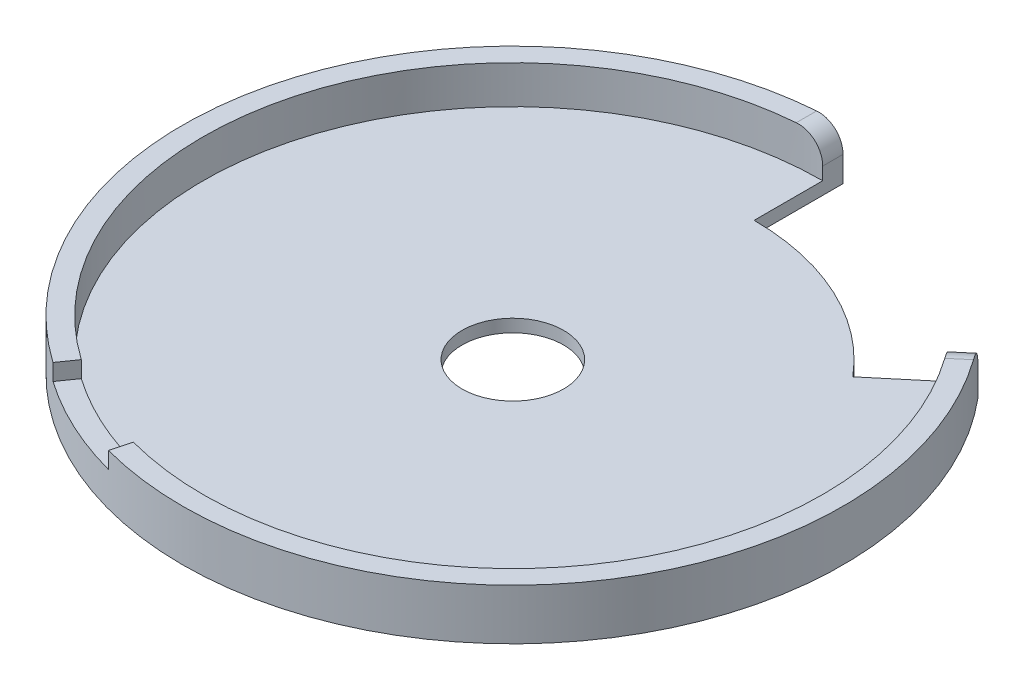
ISO-10303-21;
HEADER;
FILE_DESCRIPTION(('STEP AP214'),'2;1');
FILE_NAME('part.step','',(''),(''),'','','');
FILE_SCHEMA(('AUTOMOTIVE_DESIGN { 1 0 10303 214 1 1 1 1 }'));
ENDSEC;
DATA;
#1=APPLICATION_CONTEXT('core data for automotive mechanical design processes');
#2=APPLICATION_PROTOCOL_DEFINITION('international standard','automotive_design',2000,#1);
#3=PRODUCT_CONTEXT('',#1,'mechanical');
#4=PRODUCT('Part','Part','',(#3));
#5=PRODUCT_RELATED_PRODUCT_CATEGORY('part','',(#4));
#6=PRODUCT_DEFINITION_FORMATION('','',#4);
#7=PRODUCT_DEFINITION_CONTEXT('part definition',#1,'design');
#8=PRODUCT_DEFINITION('design','',#6,#7);
#9=PRODUCT_DEFINITION_SHAPE('','',#8);
#10=(LENGTH_UNIT() NAMED_UNIT(*) SI_UNIT(.MILLI.,.METRE.));
#11=(NAMED_UNIT(*) PLANE_ANGLE_UNIT() SI_UNIT($,.RADIAN.));
#12=(NAMED_UNIT(*) SI_UNIT($,.STERADIAN.) SOLID_ANGLE_UNIT());
#13=UNCERTAINTY_MEASURE_WITH_UNIT(LENGTH_MEASURE(1.E-05),#10,'distance_accuracy_value','');
#14=(GEOMETRIC_REPRESENTATION_CONTEXT(3) GLOBAL_UNCERTAINTY_ASSIGNED_CONTEXT((#13)) GLOBAL_UNIT_ASSIGNED_CONTEXT((#10,
#11,#12)) REPRESENTATION_CONTEXT('',''));
#15=CARTESIAN_POINT('',(0.,0.,0.));
#16=DIRECTION('',(0.,0.,1.));
#17=DIRECTION('',(1.,0.,0.));
#18=AXIS2_PLACEMENT_3D('',#15,#16,#17);
#19=CARTESIAN_POINT('',(0.,40.,0.));
#20=DIRECTION('',(0.,1.,0.));
#21=DIRECTION('',(0.,0.,1.));
#22=AXIS2_PLACEMENT_3D('',#19,#20,#21);
#23=PLANE('',#22);
#24=DIRECTION('',(-0.573576436351047,0.,0.819152044288991));
#25=VECTOR('',#24,1.);
#26=CARTESIAN_POINT('',(-139.952650469655,40.,199.873098806514));
#27=LINE('',#26,#25);
#28=CARTESIAN_POINT('',(-139.952650469655,40.,199.873098806514));
#29=VERTEX_POINT('',#28);
#30=CARTESIAN_POINT('',(-149.129873451272,40.,212.979531515138));
#31=VERTEX_POINT('',#30);
#32=EDGE_CURVE('E146',#29,#31,#27,.T.);
#33=ORIENTED_EDGE('',*,*,#32,.F.);
#34=CARTESIAN_POINT('',(0.,40.,0.));
#35=DIRECTION('',(0.,1.,0.));
#36=DIRECTION('',(0.,0.,1.));
#37=AXIS2_PLACEMENT_3D('',#34,#35,#36);
#38=CIRCLE('',#37,244.);
#39=CARTESIAN_POINT('',(-20.,40.,-243.178946457131));
#40=VERTEX_POINT('',#39);
#41=EDGE_CURVE('E187',#40,#29,#38,.T.);
#42=ORIENTED_EDGE('',*,*,#41,.F.);
#43=DIRECTION('',(0.,0.,-1.));
#44=VECTOR('',#43,1.);
#45=CARTESIAN_POINT('',(-20.,40.,0.));
#46=LINE('',#45,#44);
#47=CARTESIAN_POINT('',(-20.,40.,-259.229627936314));
#48=VERTEX_POINT('',#47);
#49=EDGE_CURVE('E213',#40,#48,#46,.T.);
#50=ORIENTED_EDGE('',*,*,#49,.T.);
#51=CARTESIAN_POINT('',(0.,40.,0.));
#52=DIRECTION('',(0.,1.,0.));
#53=DIRECTION('',(0.,0.,1.));
#54=AXIS2_PLACEMENT_3D('',#51,#52,#53);
#55=CIRCLE('',#54,260.);
#56=EDGE_CURVE('E190',#48,#31,#55,.T.);
#57=ORIENTED_EDGE('',*,*,#56,.T.);
#58=EDGE_LOOP('',(#33,#42,#50,#57));
#59=FACE_BOUND('',#58,.T.);
#60=ADVANCED_FACE('F40',(#59),#23,.T.);
#61=CARTESIAN_POINT('',(0.,10.,0.));
#62=DIRECTION('',(0.,1.,0.));
#63=DIRECTION('',(0.,0.,1.));
#64=AXIS2_PLACEMENT_3D('',#61,#62,#63);
#65=PLANE('',#64);
#66=CARTESIAN_POINT('',(0.,10.,0.));
#67=DIRECTION('',(0.,1.,0.));
#68=DIRECTION('',(0.,0.,1.));
#69=AXIS2_PLACEMENT_3D('',#66,#67,#68);
#70=CIRCLE('',#69,40.);
#71=CARTESIAN_POINT('',(0.,10.,40.));
#72=VERTEX_POINT('',#71);
#73=EDGE_CURVE('E194',#72,#72,#70,.T.);
#74=ORIENTED_EDGE('',*,*,#73,.F.);
#75=EDGE_LOOP('',(#74));
#76=FACE_BOUND('',#75,.T.);
#77=CARTESIAN_POINT('',(0.,10.,0.));
#78=DIRECTION('',(0.,1.,0.));
#79=DIRECTION('',(0.,0.,1.));
#80=AXIS2_PLACEMENT_3D('',#77,#78,#79);
#81=CIRCLE('',#80,190.);
#82=CARTESIAN_POINT('',(145.548444192606,10.,-122.129645840442));
#83=VERTEX_POINT('',#82);
#84=CARTESIAN_POINT('',(0.,10.,-190.));
#85=VERTEX_POINT('',#84);
#86=EDGE_CURVE('E183',#83,#85,#81,.T.);
#87=ORIENTED_EDGE('',*,*,#86,.T.);
#88=DIRECTION('',(0.,0.,-1.));
#89=VECTOR('',#88,1.);
#90=CARTESIAN_POINT('',(0.,10.,0.));
#91=LINE('',#90,#89);
#92=CARTESIAN_POINT('',(0.,10.,-244.));
#93=VERTEX_POINT('',#92);
#94=EDGE_CURVE('E180',#85,#93,#91,.T.);
#95=ORIENTED_EDGE('',*,*,#94,.T.);
#96=CARTESIAN_POINT('',(0.,10.,0.));
#97=DIRECTION('',(0.,1.,0.));
#98=DIRECTION('',(0.,0.,1.));
#99=AXIS2_PLACEMENT_3D('',#96,#97,#98);
#100=CIRCLE('',#99,244.);
#101=CARTESIAN_POINT('',(186.914844121031,10.,-156.840176763515));
#102=VERTEX_POINT('',#101);
#103=EDGE_CURVE('E202',#102,#93,#100,.F.);
#104=ORIENTED_EDGE('',*,*,#103,.F.);
#105=DIRECTION('',(0.766044443118979,0.,-0.642787609686538));
#106=VECTOR('',#105,1.);
#107=CARTESIAN_POINT('',(0.,10.,0.));
#108=LINE('',#107,#106);
#109=EDGE_CURVE('E170',#83,#102,#108,.T.);
#110=ORIENTED_EDGE('',*,*,#109,.F.);
#111=EDGE_LOOP('',(#87,#95,#104,#110));
#112=FACE_BOUND('',#111,.T.);
#113=ADVANCED_FACE('F266',(#76,#112),#65,.T.);
#114=CARTESIAN_POINT('',(0.,0.,0.));
#115=DIRECTION('',(0.,1.,0.));
#116=DIRECTION('',(0.,0.,1.));
#117=AXIS2_PLACEMENT_3D('',#114,#115,#116);
#118=PLANE('',#117);
#119=CARTESIAN_POINT('',(0.,0.,0.));
#120=DIRECTION('',(0.,1.,0.));
#121=DIRECTION('',(0.,0.,1.));
#122=AXIS2_PLACEMENT_3D('',#119,#120,#121);
#123=CIRCLE('',#122,40.);
#124=CARTESIAN_POINT('',(0.,0.,40.));
#125=VERTEX_POINT('',#124);
#126=EDGE_CURVE('E193',#125,#125,#123,.T.);
#127=ORIENTED_EDGE('',*,*,#126,.T.);
#128=EDGE_LOOP('',(#127));
#129=FACE_BOUND('',#128,.T.);
#130=DIRECTION('',(0.,0.,-1.));
#131=VECTOR('',#130,1.);
#132=CARTESIAN_POINT('',(0.,0.,0.));
#133=LINE('',#132,#131);
#134=CARTESIAN_POINT('',(0.,0.,-190.));
#135=VERTEX_POINT('',#134);
#136=CARTESIAN_POINT('',(0.,0.,-260.));
#137=VERTEX_POINT('',#136);
#138=EDGE_CURVE('E164',#135,#137,#133,.T.);
#139=ORIENTED_EDGE('',*,*,#138,.F.);
#140=CARTESIAN_POINT('',(0.,0.,0.));
#141=DIRECTION('',(0.,1.,0.));
#142=DIRECTION('',(0.,0.,1.));
#143=AXIS2_PLACEMENT_3D('',#140,#141,#142);
#144=CIRCLE('',#143,190.);
#145=CARTESIAN_POINT('',(145.548444192606,0.,-122.129645840442));
#146=VERTEX_POINT('',#145);
#147=EDGE_CURVE('E158',#146,#135,#144,.T.);
#148=ORIENTED_EDGE('',*,*,#147,.F.);
#149=DIRECTION('',(0.766044443118979,0.,-0.642787609686538));
#150=VECTOR('',#149,1.);
#151=CARTESIAN_POINT('',(0.,0.,0.));
#152=LINE('',#151,#150);
#153=CARTESIAN_POINT('',(199.171555210935,0.,-167.1247785185));
#154=VERTEX_POINT('',#153);
#155=EDGE_CURVE('E160',#146,#154,#152,.T.);
#156=ORIENTED_EDGE('',*,*,#155,.T.);
#157=CARTESIAN_POINT('',(0.,0.,0.));
#158=DIRECTION('',(0.,1.,0.));
#159=DIRECTION('',(0.,0.,1.));
#160=AXIS2_PLACEMENT_3D('',#157,#158,#159);
#161=CIRCLE('',#160,260.);
#162=EDGE_CURVE('E197',#137,#154,#161,.T.);
#163=ORIENTED_EDGE('',*,*,#162,.F.);
#164=EDGE_LOOP('',(#139,#148,#156,#163));
#165=FACE_BOUND('',#164,.T.);
#166=ADVANCED_FACE('F233',(#129,#165),#118,.F.);
#167=CARTESIAN_POINT('',(0.,10.,0.));
#168=DIRECTION('',(0.,-1.,0.));
#169=DIRECTION('',(0.,0.,-1.));
#170=AXIS2_PLACEMENT_3D('',#167,#168,#169);
#171=CYLINDRICAL_SURFACE('',#170,260.);
#172=CARTESIAN_POINT('',(0.,27.,0.));
#173=DIRECTION('',(0.,1.,0.));
#174=DIRECTION('',(0.,0.,1.));
#175=AXIS2_PLACEMENT_3D('',#172,#173,#174);
#176=CIRCLE('',#175,260.);
#177=CARTESIAN_POINT('',(-149.129873451272,27.,212.979531515138));
#178=VERTEX_POINT('',#177);
#179=CARTESIAN_POINT('',(-67.2929517266545,27.,251.140714835158));
#180=VERTEX_POINT('',#179);
#181=EDGE_CURVE('E137',#178,#180,#176,.T.);
#182=ORIENTED_EDGE('',*,*,#181,.F.);
#183=DIRECTION('',(0.,1.,0.));
#184=VECTOR('',#183,1.);
#185=CARTESIAN_POINT('',(-149.129873451272,27.,212.979531515138));
#186=LINE('',#185,#184);
#187=EDGE_CURVE('E161',#178,#31,#186,.T.);
#188=ORIENTED_EDGE('',*,*,#187,.T.);
#189=ORIENTED_EDGE('',*,*,#56,.F.);
#190=CARTESIAN_POINT('',(-20.,40.,-259.229627936314));
#191=CARTESIAN_POINT('',(-19.71963023319,40.0000003433928,-259.251259605967));
#192=CARTESIAN_POINT('',(-19.4392560306595,39.9941037453855,-259.272432580726));
#193=CARTESIAN_POINT('',(-18.8789397233273,39.9705247963347,-259.313833988454));
#194=CARTESIAN_POINT('',(-18.5989976096783,39.9528426899021,-259.334062441017));
#195=CARTESIAN_POINT('',(-17.7605973196725,39.8821412315805,-259.393282145943));
#196=CARTESIAN_POINT('',(-17.2034304070211,39.8114667318043,-259.430818138245));
#197=CARTESIAN_POINT('',(-16.097158092556,39.6235162871878,-259.501808322751));
#198=CARTESIAN_POINT('',(-15.5480472262984,39.5062736040331,-259.535265406103));
#199=CARTESIAN_POINT('',(-14.7332216756831,39.2961080564091,-259.582369107054));
#200=CARTESIAN_POINT('',(-14.4630765765975,39.2203324420792,-259.597557202338));
#201=CARTESIAN_POINT('',(-13.9260924750764,39.0574496866536,-259.626917452466));
#202=CARTESIAN_POINT('',(-13.6592543404177,38.9703396374848,-259.641089345131));
#203=CARTESIAN_POINT('',(-12.8643143891813,38.6921689534802,-259.682095670225));
#204=CARTESIAN_POINT('',(-12.3419154667438,38.4843009179883,-259.707413356375));
#205=CARTESIAN_POINT('',(-11.3163286813734,38.0252459934356,-259.754122740228));
#206=CARTESIAN_POINT('',(-10.8131408062476,37.7740591318687,-259.775514440423));
#207=CARTESIAN_POINT('',(-10.0755964519667,37.366208725558,-259.804817137442));
#208=CARTESIAN_POINT('',(-9.83260383115022,37.2250685973756,-259.814121148658));
#209=CARTESIAN_POINT('',(-9.3528179398351,36.9327025996843,-259.831834855501));
#210=CARTESIAN_POINT('',(-9.11602309501908,36.7814793267401,-259.840244779934));
#211=CARTESIAN_POINT('',(-8.41544794325434,36.3129909861737,-259.864192325958));
#212=CARTESIAN_POINT('',(-7.96142692776552,35.9808796905821,-259.87844968902));
#213=CARTESIAN_POINT('',(-7.0836557052645,35.2801519563588,-259.903856174274));
#214=CARTESIAN_POINT('',(-6.6598593764486,34.9115932795034,-259.915010111077));
#215=CARTESIAN_POINT('',(-5.84470458589178,34.1401019739333,-259.934618031634));
#216=CARTESIAN_POINT('',(-5.4533462650866,33.7371691958865,-259.943072003659));
#217=CARTESIAN_POINT('',(-4.70580258407628,32.8997150553843,-259.957679770067));
#218=CARTESIAN_POINT('',(-4.34962467887993,32.4651870313709,-259.963833077688));
#219=CARTESIAN_POINT('',(-3.67507101337062,31.5677053128119,-259.974244253692));
#220=CARTESIAN_POINT('',(-3.35669471514251,31.1047520228988,-259.97850214905));
#221=CARTESIAN_POINT('',(-2.75975145428004,30.1533000996564,-259.985524574331));
#222=CARTESIAN_POINT('',(-2.48121830608255,29.6647802428531,-259.988287841246));
#223=CARTESIAN_POINT('',(-1.96624521688504,28.6659903369339,-259.992692645751));
#224=CARTESIAN_POINT('',(-1.72980782558633,28.1557189726677,-259.994334115412));
#225=CARTESIAN_POINT('',(-1.30083440030042,27.1173483619554,-259.996834278522));
#226=CARTESIAN_POINT('',(-1.10827708703372,26.5892578999918,-259.997693351996));
#227=CARTESIAN_POINT('',(-0.768312740479441,25.5188219180142,-259.998920493332));
#228=CARTESIAN_POINT('',(-0.620895074602859,24.9764797876945,-259.999288676892));
#229=CARTESIAN_POINT('',(-0.414079154070954,24.0657753404818,-259.999683139849));
#230=CARTESIAN_POINT('',(-0.341755582074536,23.7002927472899,-259.999782786299));
#231=CARTESIAN_POINT('',(-0.217626554493528,22.9658652583614,-259.999916340178));
#232=CARTESIAN_POINT('',(-0.165819546275666,22.5969206267858,-259.999950252581));
#233=CARTESIAN_POINT('',(-0.082950832928738,21.8572621246842,-259.999990240716));
#234=CARTESIAN_POINT('',(-0.0518588466107511,21.486551638002,-259.999996357156));
#235=CARTESIAN_POINT('',(-0.0103757520134408,20.7438955815616,-259.999999918523));
#236=CARTESIAN_POINT('',(1.09685559338387E-05,20.3719497667453,-259.999997361612));
#237=CARTESIAN_POINT('',(0.,20.,-260.));
#238=B_SPLINE_CURVE_WITH_KNOTS('',3,(#190,#191,#192,#193,#194,#195,#196,#197,#198,#199,#200,
#201,#202,#203,#204,#205,#206,#207,#208,#209,#210,#211,#212,#213,#214,#215,#216,#217,#218,#219,
#220,#221,#222,#223,#224,#225,#226,#227,#228,#229,#230,#231,#232,#233,#234,#235,#236,#237),
.UNSPECIFIED.,.F.,.F.,(4,2,2,2,2,2,2,2,2,2,2,2,2,2,2,2,2,2,2,2,2,2,2,4),(0.,0.843485041896762,
1.68695257761325,3.37348339970604,5.05881176408558,5.9015396333662,6.74448414906235,
8.43077044189332,10.1170556644621,10.9603235850852,11.8033751837356,13.4893071036572,
15.172608721575,16.855917652671,18.5395825284052,20.2232234427925,21.9082848730087,
23.5934483311515,25.277792835917,26.9617402896422,28.0789221002924,29.1960193497417,
30.3114800240884,31.4271770536641),.UNSPECIFIED.);
#239=CARTESIAN_POINT('',(0.,20.,-260.));
#240=VERTEX_POINT('',#239);
#241=EDGE_CURVE('E223',#48,#240,#238,.T.);
#242=ORIENTED_EDGE('',*,*,#241,.T.);
#243=DIRECTION('',(0.,1.,0.));
#244=VECTOR('',#243,1.);
#245=CARTESIAN_POINT('',(0.,0.,-260.));
#246=LINE('',#245,#244);
#247=EDGE_CURVE('E171',#137,#240,#246,.T.);
#248=ORIENTED_EDGE('',*,*,#247,.F.);
#249=ORIENTED_EDGE('',*,*,#162,.T.);
#250=DIRECTION('',(0.,1.,0.));
#251=VECTOR('',#250,1.);
#252=CARTESIAN_POINT('',(199.171555210935,0.,-167.1247785185));
#253=LINE('',#252,#251);
#254=CARTESIAN_POINT('',(199.171555210935,20.,-167.1247785185));
#255=VERTEX_POINT('',#254);
#256=EDGE_CURVE('E174',#154,#255,#253,.T.);
#257=ORIENTED_EDGE('',*,*,#256,.T.);
#258=CARTESIAN_POINT('',(199.171555210935,20.,-167.1247785185));
#259=CARTESIAN_POINT('',(199.171554491482,20.2812658629448,-167.124778361103));
#260=CARTESIAN_POINT('',(199.175369570374,20.5625004366831,-167.120232864921));
#261=CARTESIAN_POINT('',(199.190616012421,21.1244625662427,-167.102060722216));
#262=CARTESIAN_POINT('',(199.202047193909,21.4051901339972,-167.088434292298));
#263=CARTESIAN_POINT('',(199.247734331528,22.245821094565,-167.033956946783));
#264=CARTESIAN_POINT('',(199.293383897176,22.8043184588376,-166.979507964408));
#265=CARTESIAN_POINT('',(199.41462434993,23.9129220375701,-166.8346980839));
#266=CARTESIAN_POINT('',(199.490192899766,24.4630341948798,-166.744363977141));
#267=CARTESIAN_POINT('',(199.625446202517,25.2791442412815,-166.582370264541));
#268=CARTESIAN_POINT('',(199.674183154871,25.5496820922155,-166.523954007258));
#269=CARTESIAN_POINT('',(199.778863788576,26.0873821323232,-166.398354178304));
#270=CARTESIAN_POINT('',(199.834809314876,26.3545434380216,-166.331168362111));
#271=CARTESIAN_POINT('',(200.013300323453,27.150303810022,-166.116568920179));
#272=CARTESIAN_POINT('',(200.14648749881,27.6731025970718,-165.956128527241));
#273=CARTESIAN_POINT('',(200.440015664363,28.6992656058067,-165.601488612789));
#274=CARTESIAN_POINT('',(200.600356648084,29.2026298321261,-165.407289099325));
#275=CARTESIAN_POINT('',(200.860106998504,29.9403071287651,-165.091598633957));
#276=CARTESIAN_POINT('',(200.949905807449,30.1833256493386,-164.982292427539));
#277=CARTESIAN_POINT('',(201.135703495956,30.6631209148689,-164.755729024502));
#278=CARTESIAN_POINT('',(201.231700781722,30.8998992424723,-164.638473871389));
#279=CARTESIAN_POINT('',(201.528734488828,31.60036774549,-164.274974132748));
#280=CARTESIAN_POINT('',(201.738830151301,32.0542407721695,-164.016974163488));
#281=CARTESIAN_POINT('',(202.181173529846,32.9321638129348,-163.471392998235));
#282=CARTESIAN_POINT('',(202.413415551536,33.3562214448425,-163.183819404873));
#283=CARTESIAN_POINT('',(202.898120064262,34.1717056744997,-162.58075677978));
#284=CARTESIAN_POINT('',(203.150582658367,34.5631321058996,-162.265267605756));
#285=CARTESIAN_POINT('',(203.673605562925,35.3106111997474,-161.608287779983));
#286=CARTESIAN_POINT('',(203.944169076797,35.6666575729372,-161.26679252431));
#287=CARTESIAN_POINT('',(204.501064899827,36.340766453533,-160.560010029154));
#288=CARTESIAN_POINT('',(204.787396955929,36.6588295702414,-160.194723171467));
#289=CARTESIAN_POINT('',(205.373190009658,37.254460702878,-159.44302944903));
#290=CARTESIAN_POINT('',(205.672639325553,37.5320638343232,-159.056641303547));
#291=CARTESIAN_POINT('',(206.282468868056,38.045166096195,-158.264944525697));
#292=CARTESIAN_POINT('',(206.592849741915,38.2806627284821,-157.859634772527));
#293=CARTESIAN_POINT('',(207.221874239612,38.7077840727051,-157.033004417618));
#294=CARTESIAN_POINT('',(207.540514000695,38.8994288965491,-156.611691259374));
#295=CARTESIAN_POINT('',(208.183646821511,39.2376343435918,-155.755756002289));
#296=CARTESIAN_POINT('',(208.508138483382,39.3842055865171,-155.32113706498));
#297=CARTESIAN_POINT('',(209.05027016703,39.5895746634136,-154.590155635691));
#298=CARTESIAN_POINT('',(209.266987242077,39.6612982742836,-154.296670240893));
#299=CARTESIAN_POINT('',(209.701194379732,39.7843712705844,-153.706029079294));
#300=CARTESIAN_POINT('',(209.918684383133,39.8357221840246,-153.408873589484));
#301=CARTESIAN_POINT('',(210.353401366117,39.9178421120331,-152.812245768728));
#302=CARTESIAN_POINT('',(210.570628246069,39.9486421347024,-152.512777621077));
#303=CARTESIAN_POINT('',(211.004509636666,39.9897286368536,-151.91193083629));
#304=CARTESIAN_POINT('',(211.221164020249,40.0000108912046,-151.610551818472));
#305=CARTESIAN_POINT('',(211.437168166145,40.,-151.308704038735));
#306=B_SPLINE_CURVE_WITH_KNOTS('',3,(#258,#259,#260,#261,#262,#263,#264,#265,#266,#267,#268,
#269,#270,#271,#272,#273,#274,#275,#276,#277,#278,#279,#280,#281,#282,#283,#284,#285,#286,#287,
#288,#289,#290,#291,#292,#293,#294,#295,#296,#297,#298,#299,#300,#301,#302,#303,#304,#305),
.UNSPECIFIED.,.F.,.F.,(4,2,2,2,2,2,2,2,2,2,2,2,2,2,2,2,2,2,2,2,2,2,2,4),(0.,0.843672533362317,
1.68732494353202,3.37419404198823,5.0598061053433,5.90268100672644,6.74577206204334,
8.43219118136804,10.1186098985534,10.9619699169116,11.8051139415565,13.4912333224823,
15.176920323153,16.8626159167139,18.5486106301863,20.2345782943978,21.9190738682577,
23.6036693485363,25.2874906613572,26.9709149467822,28.0858273977114,29.2006562112743,
30.3137990944682,31.4271711784874),.UNSPECIFIED.);
#307=CARTESIAN_POINT('',(211.437168166145,40.,-151.308704038735));
#308=VERTEX_POINT('',#307);
#309=EDGE_CURVE('E216',#255,#308,#306,.T.);
#310=ORIENTED_EDGE('',*,*,#309,.T.);
#311=CARTESIAN_POINT('',(-67.2929517266545,40.,251.140714835158));
#312=VERTEX_POINT('',#311);
#313=EDGE_CURVE('E151',#312,#308,#55,.T.);
#314=ORIENTED_EDGE('',*,*,#313,.F.);
#315=DIRECTION('',(0.,1.,0.));
#316=VECTOR('',#315,1.);
#317=CARTESIAN_POINT('',(-67.2929517266545,27.,251.140714835158));
#318=LINE('',#317,#316);
#319=EDGE_CURVE('E131',#180,#312,#318,.T.);
#320=ORIENTED_EDGE('',*,*,#319,.F.);
#321=EDGE_LOOP('',(#182,#188,#189,#242,#248,#249,#257,#310,#314,#320));
#322=FACE_BOUND('',#321,.T.);
#323=ADVANCED_FACE('F149',(#322),#171,.T.);
#324=DIRECTION('',(0.25881904510252,0.,-0.965925826289068));
#325=VECTOR('',#324,1.);
#326=CARTESIAN_POINT('',(-63.1518470050142,40.,235.685901614533));
#327=LINE('',#326,#325);
#328=CARTESIAN_POINT('',(-63.1518470050142,40.,235.685901614533));
#329=VERTEX_POINT('',#328);
#330=EDGE_CURVE('E302',#312,#329,#327,.T.);
#331=ORIENTED_EDGE('',*,*,#330,.F.);
#332=ORIENTED_EDGE('',*,*,#313,.T.);
#333=DIRECTION('',(0.766044443118979,0.,-0.642787609686538));
#334=VECTOR('',#333,1.);
#335=CARTESIAN_POINT('',(199.770596314762,40.,-141.519287901136));
#336=LINE('',#335,#334);
#337=CARTESIAN_POINT('',(199.141632810743,40.,-140.99152485689));
#338=VERTEX_POINT('',#337);
#339=EDGE_CURVE('E210',#308,#338,#336,.F.);
#340=ORIENTED_EDGE('',*,*,#339,.T.);
#341=EDGE_CURVE('E186',#329,#338,#38,.T.);
#342=ORIENTED_EDGE('',*,*,#341,.F.);
#343=EDGE_LOOP('',(#331,#332,#340,#342));
#344=FACE_BOUND('',#343,.T.);
#345=ADVANCED_FACE('F232',(#344),#23,.T.);
#346=CARTESIAN_POINT('',(0.,40.,0.));
#347=DIRECTION('',(0.,-1.,0.));
#348=DIRECTION('',(0.,0.,-1.));
#349=AXIS2_PLACEMENT_3D('',#346,#347,#348);
#350=CYLINDRICAL_SURFACE('',#349,244.);
#351=DIRECTION('',(0.,1.,0.));
#352=VECTOR('',#351,1.);
#353=CARTESIAN_POINT('',(-139.952650469655,27.,199.873098806514));
#354=LINE('',#353,#352);
#355=CARTESIAN_POINT('',(-139.952650469655,27.,199.873098806514));
#356=VERTEX_POINT('',#355);
#357=EDGE_CURVE('E153',#356,#29,#354,.T.);
#358=ORIENTED_EDGE('',*,*,#357,.F.);
#359=CARTESIAN_POINT('',(0.,27.,0.));
#360=DIRECTION('',(0.,-1.,0.));
#361=DIRECTION('',(0.,0.,1.));
#362=AXIS2_PLACEMENT_3D('',#359,#360,#361);
#363=CIRCLE('',#362,244.);
#364=CARTESIAN_POINT('',(-63.1518470050142,27.,235.685901614533));
#365=VERTEX_POINT('',#364);
#366=EDGE_CURVE('E136',#365,#356,#363,.T.);
#367=ORIENTED_EDGE('',*,*,#366,.F.);
#368=DIRECTION('',(0.,1.,0.));
#369=VECTOR('',#368,1.);
#370=CARTESIAN_POINT('',(-63.1518470050142,27.,235.685901614533));
#371=LINE('',#370,#369);
#372=EDGE_CURVE('E134',#365,#329,#371,.T.);
#373=ORIENTED_EDGE('',*,*,#372,.T.);
#374=ORIENTED_EDGE('',*,*,#341,.T.);
#375=CARTESIAN_POINT('',(199.141632810743,40.,-140.99152485689));
#376=CARTESIAN_POINT('',(198.979150891471,40.0000003435848,-141.221021550371));
#377=CARTESIAN_POINT('',(198.816288774564,39.9941089473776,-141.450211323156));
#378=CARTESIAN_POINT('',(198.490065137133,39.970549589358,-141.907621004442));
#379=CARTESIAN_POINT('',(198.326703626833,39.9528818670852,-142.135840932575));
#380=CARTESIAN_POINT('',(197.836329052453,39.8822353901431,-142.818418028193));
#381=CARTESIAN_POINT('',(197.508948656605,39.8116133177467,-143.270801660178));
#382=CARTESIAN_POINT('',(196.856010044505,39.6237893071046,-144.166633878056));
#383=CARTESIAN_POINT('',(196.53045070333,39.5066203458351,-144.610088556629));
#384=CARTESIAN_POINT('',(196.045260419152,39.2965753797259,-145.266410571274));
#385=CARTESIAN_POINT('',(195.884049147463,39.2208416664113,-145.483715863106));
#386=CARTESIAN_POINT('',(195.56291654748,39.0580451759169,-145.915105425218));
#387=CARTESIAN_POINT('',(195.402995561603,38.9709794900829,-146.129188852726));
#388=CARTESIAN_POINT('',(194.925571106126,38.6929418915559,-146.766151231387));
#389=CARTESIAN_POINT('',(194.610486973554,38.485164427219,-147.183632992192));
#390=CARTESIAN_POINT('',(193.989443343774,38.0262908113285,-148.001214446463));
#391=CARTESIAN_POINT('',(193.683483839815,37.7751946918295,-148.401314152791));
#392=CARTESIAN_POINT('',(193.233339897799,37.3674785025833,-148.986365190748));
#393=CARTESIAN_POINT('',(193.084747363356,37.2263830976027,-149.178879174187));
#394=CARTESIAN_POINT('',(192.790813480894,36.9341055385016,-149.55854992224));
#395=CARTESIAN_POINT('',(192.64547130847,36.7829259817204,-149.745708048732));
#396=CARTESIAN_POINT('',(192.214698580869,36.3145669770376,-150.298795428718));
#397=CARTESIAN_POINT('',(191.934491143502,35.9825394233427,-150.656377509441));
#398=CARTESIAN_POINT('',(191.391043306099,35.2820465985939,-151.34616327291));
#399=CARTESIAN_POINT('',(191.12777375848,34.9136468478834,-151.678410745776));
#400=CARTESIAN_POINT('',(190.619864802884,34.1424810571771,-152.316228109624));
#401=CARTESIAN_POINT('',(190.37522547334,33.7397148725125,-152.621797888294));
#402=CARTESIAN_POINT('',(189.906661395573,32.9025991847397,-153.204437937943));
#403=CARTESIAN_POINT('',(189.682741067923,32.4682429767791,-153.481502128421));
#404=CARTESIAN_POINT('',(189.257635797897,31.5711086792008,-154.005393170866));
#405=CARTESIAN_POINT('',(189.056450535548,31.1083309897278,-154.252220448391));
#406=CARTESIAN_POINT('',(188.67841670948,30.1571893813543,-154.714395980536));
#407=CARTESIAN_POINT('',(188.501591041293,29.668801979076,-154.929714631933));
#408=CARTESIAN_POINT('',(188.174069472779,28.6702728242146,-155.327351002831));
#409=CARTESIAN_POINT('',(188.02337515231,28.1601297586423,-155.509666727058));
#410=CARTESIAN_POINT('',(187.749555228314,27.1220088938409,-155.840144246305));
#411=CARTESIAN_POINT('',(187.626416307981,26.5940398520408,-155.988322540081));
#412=CARTESIAN_POINT('',(187.408748731423,25.5238387874213,-156.249767679315));
#413=CARTESIAN_POINT('',(187.314213356691,24.9816101465231,-156.363042723093));
#414=CARTESIAN_POINT('',(187.181387895757,24.0706000832526,-156.521994468679));
#415=CARTESIAN_POINT('',(187.13486975073,23.7046951454,-156.577598614235));
#416=CARTESIAN_POINT('',(187.054999596581,22.9694104668254,-156.673006617173));
#417=CARTESIAN_POINT('',(187.021646593189,22.6000309906689,-156.712811667751));
#418=CARTESIAN_POINT('',(186.968284353917,21.8594938034829,-156.776472917722));
#419=CARTESIAN_POINT('',(186.948255686368,21.4883394805466,-156.800352342528));
#420=CARTESIAN_POINT('',(186.921529533998,20.7447915880106,-156.832209262813));
#421=CARTESIAN_POINT('',(186.914834870768,20.3723977728197,-156.840183392596));
#422=CARTESIAN_POINT('',(186.914844121031,20.,-156.840176763515));
#423=B_SPLINE_CURVE_WITH_KNOTS('',3,(#375,#376,#377,#378,#379,#380,#381,#382,#383,#384,#385,
#386,#387,#388,#389,#390,#391,#392,#393,#394,#395,#396,#397,#398,#399,#400,#401,#402,#403,#404,
#405,#406,#407,#408,#409,#410,#411,#412,#413,#414,#415,#416,#417,#418,#419,#420,#421,#422),
.UNSPECIFIED.,.F.,.F.,(4,2,2,2,2,2,2,2,2,2,2,2,2,2,2,2,2,2,2,2,2,2,2,4),(0.,0.843453026715168,
1.68688889745822,3.37336069961697,5.05863981538737,5.90134235151505,6.74426161797573,
8.43051987273962,10.1167768797195,10.9600274925052,11.803061744672,13.4889585145586,
15.1718719026989,16.8547923755682,18.538071089693,20.2213261104474,21.9061525796278,
23.591080875083,25.2751931215968,26.9589094899189,28.0774328776099,29.1958717749448,
30.3126759897389,31.4297165047396),.UNSPECIFIED.);
#424=CARTESIAN_POINT('',(186.914844121031,20.,-156.840176763515));
#425=VERTEX_POINT('',#424);
#426=EDGE_CURVE('E64',#338,#425,#423,.T.);
#427=ORIENTED_EDGE('',*,*,#426,.T.);
#428=DIRECTION('',(0.,-1.,0.));
#429=VECTOR('',#428,1.);
#430=CARTESIAN_POINT('',(186.914844121031,40.,-156.840176763515));
#431=LINE('',#430,#429);
#432=EDGE_CURVE('E205',#102,#425,#431,.F.);
#433=ORIENTED_EDGE('',*,*,#432,.F.);
#434=ORIENTED_EDGE('',*,*,#103,.T.);
#435=DIRECTION('',(0.,-1.,0.));
#436=VECTOR('',#435,1.);
#437=CARTESIAN_POINT('',(0.,40.,-244.));
#438=LINE('',#437,#436);
#439=CARTESIAN_POINT('',(0.,20.,-244.));
#440=VERTEX_POINT('',#439);
#441=EDGE_CURVE('E207',#93,#440,#438,.F.);
#442=ORIENTED_EDGE('',*,*,#441,.T.);
#443=CARTESIAN_POINT('',(0.,20.,-244.));
#444=CARTESIAN_POINT('',(3.41888492976386E-07,20.2812636337542,-243.999999304942));
#445=CARTESIAN_POINT('',(-0.00593390157275631,20.562495979109,-244.000000084236));
#446=CARTESIAN_POINT('',(-0.0296544187452636,21.1244536634199,-243.99999861809));
#447=CARTESIAN_POINT('',(-0.0474404097418833,21.4051790143098,-243.999996372722));
#448=CARTESIAN_POINT('',(-0.118538479500461,22.2458033799975,-243.999976143645));
#449=CARTESIAN_POINT('',(-0.1895906739878,22.8042963993353,-243.999944672772));
#450=CARTESIAN_POINT('',(-0.378450499550004,23.9128922446937,-243.999724721852));
#451=CARTESIAN_POINT('',(-0.496223314200273,24.4630010024284,-243.999536358607));
#452=CARTESIAN_POINT('',(-0.70725392770195,25.2791061117338,-243.998984928744));
#453=CARTESIAN_POINT('',(-0.783329840320601,25.5496423424017,-243.998756289792));
#454=CARTESIAN_POINT('',(-0.946830069562885,26.0873392027493,-243.998176637753));
#455=CARTESIAN_POINT('',(-1.03425729171085,26.3544989488924,-243.997825593295));
#456=CARTESIAN_POINT('',(-1.31337811009866,27.1502549832603,-243.996536477918));
#457=CARTESIAN_POINT('',(-1.5218909384803,27.6730510660757,-243.995362457482));
#458=CARTESIAN_POINT('',(-1.98223109042041,28.6992087388085,-243.992056569771));
#459=CARTESIAN_POINT('',(-2.23405840146062,29.2025703343425,-243.989924702773));
#460=CARTESIAN_POINT('',(-2.64284997186715,29.9402436031987,-243.985724719112));
#461=CARTESIAN_POINT('',(-2.78430297217117,30.1832608004965,-243.984157508997));
#462=CARTESIAN_POINT('',(-3.07728482317012,30.6630533136881,-243.980638135643));
#463=CARTESIAN_POINT('',(-3.22881108410252,30.8998302122249,-243.978686071095));
#464=CARTESIAN_POINT('',(-3.69819027104727,31.6002941631524,-243.972173288045));
#465=CARTESIAN_POINT('',(-4.03087096381642,32.0541638325105,-243.966955720897));
#466=CARTESIAN_POINT('',(-4.73311762006789,32.9320641896601,-243.954341727919));
#467=CARTESIAN_POINT('',(-5.10267286510417,33.3561034875917,-243.946945934028));
#468=CARTESIAN_POINT('',(-5.87615867010683,34.1715513514579,-243.929539724099));
#469=CARTESIAN_POINT('',(-6.28008940417151,34.5629597521099,-243.919529294818));
#470=CARTESIAN_POINT('',(-7.11949180489079,35.3104016282664,-243.896472106869));
#471=CARTESIAN_POINT('',(-7.55496895570331,35.6664289273365,-243.883424819384));
#472=CARTESIAN_POINT('',(-8.45427249084762,36.3405000729669,-243.853906321376));
#473=CARTESIAN_POINT('',(-8.91809841772377,36.6585445322004,-243.837435166092));
#474=CARTESIAN_POINT('',(-9.87028434601261,37.2540975726711,-243.800746966349));
#475=CARTESIAN_POINT('',(-10.3586189788655,37.5316469523622,-243.780533739249));
#476=CARTESIAN_POINT('',(-11.3567815685904,38.044657280363,-243.736072520536));
#477=CARTESIAN_POINT('',(-11.8666107925756,38.2801157430998,-243.711824290809));
#478=CARTESIAN_POINT('',(-12.9038183614399,38.7071816963988,-243.659108202674));
#479=CARTESIAN_POINT('',(-13.4311886279817,38.8988090611914,-243.630642266378));
#480=CARTESIAN_POINT('',(-14.4998546364377,39.2370045970094,-243.569374997841));
#481=CARTESIAN_POINT('',(-15.0411470747672,39.3835833526254,-243.536574686595));
#482=CARTESIAN_POINT('',(-15.9495866503153,39.5890819912536,-243.478423276017));
#483=CARTESIAN_POINT('',(-16.3139507075139,39.6608963448436,-243.454286583758));
#484=CARTESIAN_POINT('',(-17.0459787013553,39.7841218773644,-243.404127238826));
#485=CARTESIAN_POINT('',(-17.4136423892257,39.8355345814595,-243.378104727303));
#486=CARTESIAN_POINT('',(-18.1505620032421,39.9177510400496,-243.324255413841));
#487=CARTESIAN_POINT('',(-18.5198146725844,39.9485859043278,-243.29643140561));
#488=CARTESIAN_POINT('',(-19.2594005936545,39.989717955733,-243.239005016103));
#489=CARTESIAN_POINT('',(-19.6297340511766,40.000010935921,-243.209402271824));
#490=CARTESIAN_POINT('',(-20.,40.,-243.178946457131));
#491=B_SPLINE_CURVE_WITH_KNOTS('',3,(#443,#444,#445,#446,#447,#448,#449,#450,#451,#452,#453,
#454,#455,#456,#457,#458,#459,#460,#461,#462,#463,#464,#465,#466,#467,#468,#469,#470,#471,#472,
#473,#474,#475,#476,#477,#478,#479,#480,#481,#482,#483,#484,#485,#486,#487,#488,#489,#490),
.UNSPECIFIED.,.F.,.F.,(4,2,2,2,2,2,2,2,2,2,2,2,2,2,2,2,2,2,2,2,2,2,2,4),(0.,0.843665848887379,
1.68731157347271,3.37416736841751,5.05976846482927,5.90263787247598,6.74572345107792,
8.43213244212661,10.1185409457895,10.961896094393,11.8050352547802,13.4911448027485,
15.176765663659,16.8623950620826,18.5483182037063,20.234214147276,21.9183996589591,
23.602684593137,25.2862043053523,26.9693281559791,28.0852745286624,29.2011374609245,
30.3153095756038,31.4297098472108),.UNSPECIFIED.);
#492=EDGE_CURVE('E49',#440,#40,#491,.T.);
#493=ORIENTED_EDGE('',*,*,#492,.T.);
#494=ORIENTED_EDGE('',*,*,#41,.T.);
#495=EDGE_LOOP('',(#358,#367,#373,#374,#427,#433,#434,#442,#493,#494));
#496=FACE_BOUND('',#495,.T.);
#497=ADVANCED_FACE('F252',(#496),#350,.F.);
#498=CARTESIAN_POINT('',(0.,10.,0.));
#499=DIRECTION('',(0.,-1.,0.));
#500=DIRECTION('',(0.,0.,-1.));
#501=AXIS2_PLACEMENT_3D('',#498,#499,#500);
#502=CYLINDRICAL_SURFACE('',#501,40.);
#503=ORIENTED_EDGE('',*,*,#73,.T.);
#504=EDGE_LOOP('',(#503));
#505=FACE_BOUND('',#504,.T.);
#506=ORIENTED_EDGE('',*,*,#126,.F.);
#507=EDGE_LOOP('',(#506));
#508=FACE_BOUND('',#507,.T.);
#509=ADVANCED_FACE('F257',(#505,#508),#502,.F.);
#510=CARTESIAN_POINT('',(0.,0.,0.));
#511=DIRECTION('',(0.,1.,0.));
#512=DIRECTION('',(0.,0.,1.));
#513=AXIS2_PLACEMENT_3D('',#510,#511,#512);
#514=CYLINDRICAL_SURFACE('',#513,190.);
#515=DIRECTION('',(0.,1.,0.));
#516=VECTOR('',#515,1.);
#517=CARTESIAN_POINT('',(145.548444192606,0.,-122.129645840442));
#518=LINE('',#517,#516);
#519=EDGE_CURVE('E166',#146,#83,#518,.T.);
#520=ORIENTED_EDGE('',*,*,#519,.F.);
#521=ORIENTED_EDGE('',*,*,#147,.T.);
#522=DIRECTION('',(0.,1.,0.));
#523=VECTOR('',#522,1.);
#524=CARTESIAN_POINT('',(0.,0.,-190.));
#525=LINE('',#524,#523);
#526=EDGE_CURVE('E167',#135,#85,#525,.T.);
#527=ORIENTED_EDGE('',*,*,#526,.T.);
#528=ORIENTED_EDGE('',*,*,#86,.F.);
#529=EDGE_LOOP('',(#520,#521,#527,#528));
#530=FACE_BOUND('',#529,.T.);
#531=ADVANCED_FACE('F258',(#530),#514,.T.);
#532=CARTESIAN_POINT('',(0.,0.,0.));
#533=DIRECTION('',(1.,0.,0.));
#534=DIRECTION('',(0.,0.,-1.));
#535=AXIS2_PLACEMENT_3D('',#532,#533,#534);
#536=PLANE('',#535);
#537=ORIENTED_EDGE('',*,*,#247,.T.);
#538=DIRECTION('',(0.,0.,-1.));
#539=VECTOR('',#538,1.);
#540=CARTESIAN_POINT('',(0.,20.,0.));
#541=LINE('',#540,#539);
#542=EDGE_CURVE('E291',#240,#440,#541,.F.);
#543=ORIENTED_EDGE('',*,*,#542,.T.);
#544=ORIENTED_EDGE('',*,*,#441,.F.);
#545=ORIENTED_EDGE('',*,*,#94,.F.);
#546=ORIENTED_EDGE('',*,*,#526,.F.);
#547=ORIENTED_EDGE('',*,*,#138,.T.);
#548=EDGE_LOOP('',(#537,#543,#544,#545,#546,#547));
#549=FACE_BOUND('',#548,.T.);
#550=ADVANCED_FACE('F288',(#549),#536,.T.);
#551=CARTESIAN_POINT('',(0.,0.,0.));
#552=DIRECTION('',(0.642787609686538,0.,0.766044443118979));
#553=DIRECTION('',(0.766044443118979,0.,-0.642787609686538));
#554=AXIS2_PLACEMENT_3D('',#551,#552,#553);
#555=PLANE('',#554);
#556=ORIENTED_EDGE('',*,*,#432,.T.);
#557=DIRECTION('',(0.766044443118979,0.,-0.642787609686538));
#558=VECTOR('',#557,1.);
#559=CARTESIAN_POINT('',(199.171555210935,20.,-167.1247785185));
#560=LINE('',#559,#558);
#561=EDGE_CURVE('E11',#425,#255,#560,.T.);
#562=ORIENTED_EDGE('',*,*,#561,.T.);
#563=ORIENTED_EDGE('',*,*,#256,.F.);
#564=ORIENTED_EDGE('',*,*,#155,.F.);
#565=ORIENTED_EDGE('',*,*,#519,.T.);
#566=ORIENTED_EDGE('',*,*,#109,.T.);
#567=EDGE_LOOP('',(#556,#562,#563,#564,#565,#566));
#568=FACE_BOUND('',#567,.T.);
#569=ADVANCED_FACE('F239',(#568),#555,.F.);
#570=CARTESIAN_POINT('',(-20.,20.,0.));
#571=DIRECTION('',(0.,0.,-1.));
#572=DIRECTION('',(-1.,0.,0.));
#573=AXIS2_PLACEMENT_3D('',#570,#571,#572);
#574=CYLINDRICAL_SURFACE('',#573,20.);
#575=ORIENTED_EDGE('',*,*,#492,.F.);
#576=ORIENTED_EDGE('',*,*,#542,.F.);
#577=ORIENTED_EDGE('',*,*,#241,.F.);
#578=ORIENTED_EDGE('',*,*,#49,.F.);
#579=EDGE_LOOP('',(#575,#576,#577,#578));
#580=FACE_BOUND('',#579,.T.);
#581=ADVANCED_FACE('F235',(#580),#574,.T.);
#582=CARTESIAN_POINT('',(12.8557521937308,20.,15.3208888623796));
#583=DIRECTION('',(-0.766044443118979,0.,0.642787609686538));
#584=DIRECTION('',(0.642787609686538,0.,0.766044443118979));
#585=AXIS2_PLACEMENT_3D('',#582,#583,#584);
#586=CYLINDRICAL_SURFACE('',#585,20.);
#587=ORIENTED_EDGE('',*,*,#426,.F.);
#588=ORIENTED_EDGE('',*,*,#339,.F.);
#589=ORIENTED_EDGE('',*,*,#309,.F.);
#590=ORIENTED_EDGE('',*,*,#561,.F.);
#591=EDGE_LOOP('',(#587,#588,#589,#590));
#592=FACE_BOUND('',#591,.T.);
#593=ADVANCED_FACE('F42',(#592),#586,.T.);
#594=CARTESIAN_POINT('',(-139.952650469655,27.,199.873098806514));
#595=DIRECTION('',(-0.819152044288991,0.,-0.573576436351047));
#596=DIRECTION('',(-0.573576436351047,0.,0.819152044288991));
#597=AXIS2_PLACEMENT_3D('',#594,#595,#596);
#598=PLANE('',#597);
#599=ORIENTED_EDGE('',*,*,#32,.T.);
#600=ORIENTED_EDGE('',*,*,#187,.F.);
#601=DIRECTION('',(-0.573576436351047,0.,0.819152044288991));
#602=VECTOR('',#601,1.);
#603=CARTESIAN_POINT('',(-139.952650469655,27.,199.873098806514));
#604=LINE('',#603,#602);
#605=EDGE_CURVE('E143',#356,#178,#604,.T.);
#606=ORIENTED_EDGE('',*,*,#605,.F.);
#607=ORIENTED_EDGE('',*,*,#357,.T.);
#608=EDGE_LOOP('',(#599,#600,#606,#607));
#609=FACE_BOUND('',#608,.T.);
#610=ADVANCED_FACE('F304',(#609),#598,.F.);
#611=CARTESIAN_POINT('',(-63.1518470050142,27.,235.685901614533));
#612=DIRECTION('',(0.965925826289069,0.,0.25881904510252));
#613=DIRECTION('',(0.25881904510252,0.,-0.965925826289069));
#614=AXIS2_PLACEMENT_3D('',#611,#612,#613);
#615=PLANE('',#614);
#616=ORIENTED_EDGE('',*,*,#330,.T.);
#617=ORIENTED_EDGE('',*,*,#372,.F.);
#618=DIRECTION('',(0.25881904510252,0.,-0.965925826289068));
#619=VECTOR('',#618,1.);
#620=CARTESIAN_POINT('',(-63.1518470050142,27.,235.685901614533));
#621=LINE('',#620,#619);
#622=EDGE_CURVE('E56',#180,#365,#621,.T.);
#623=ORIENTED_EDGE('',*,*,#622,.F.);
#624=ORIENTED_EDGE('',*,*,#319,.T.);
#625=EDGE_LOOP('',(#616,#617,#623,#624));
#626=FACE_BOUND('',#625,.T.);
#627=ADVANCED_FACE('F129',(#626),#615,.F.);
#628=CARTESIAN_POINT('',(0.,27.,0.));
#629=DIRECTION('',(0.,1.,0.));
#630=DIRECTION('',(0.,0.,1.));
#631=AXIS2_PLACEMENT_3D('',#628,#629,#630);
#632=PLANE('',#631);
#633=ORIENTED_EDGE('',*,*,#181,.T.);
#634=ORIENTED_EDGE('',*,*,#622,.T.);
#635=ORIENTED_EDGE('',*,*,#366,.T.);
#636=ORIENTED_EDGE('',*,*,#605,.T.);
#637=EDGE_LOOP('',(#633,#634,#635,#636));
#638=FACE_BOUND('',#637,.T.);
#639=ADVANCED_FACE('F141',(#638),#632,.T.);
#640=CLOSED_SHELL('',(#60,#113,#166,#323,#345,#497,#509,#531,#550,#569,#581,#593,#610,#627,#639));
#641=MANIFOLD_SOLID_BREP('B2',#640);
#642=ADVANCED_BREP_SHAPE_REPRESENTATION('',(#18,#641),#14);
#643=SHAPE_DEFINITION_REPRESENTATION(#9,#642);
ENDSEC;
END-ISO-10303-21;
